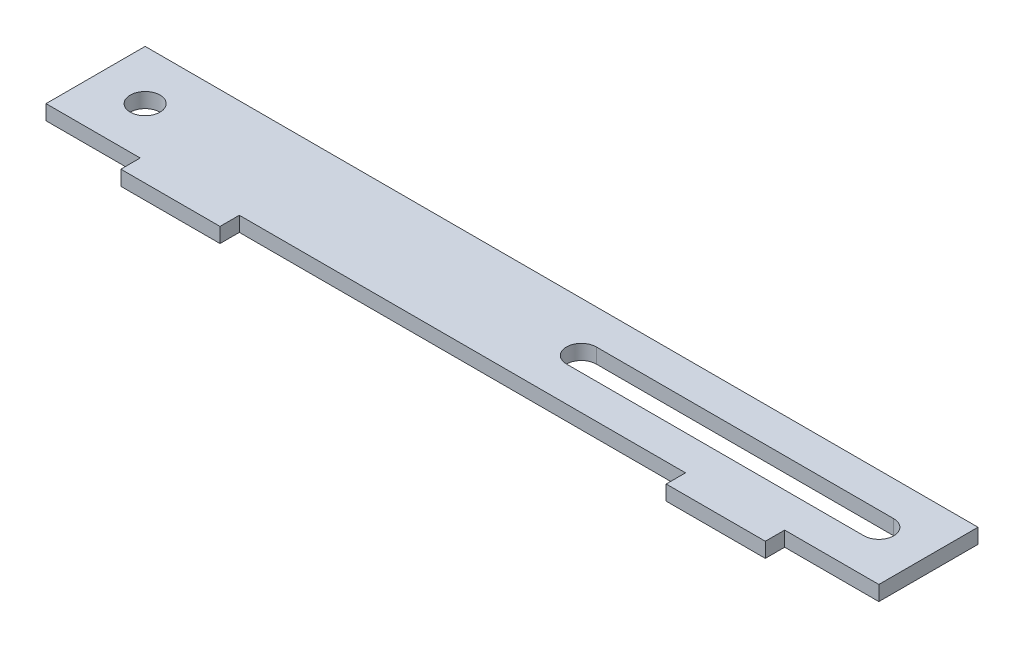
ISO-10303-21;
HEADER;
FILE_DESCRIPTION(('STEP AP214'),'2;1');
FILE_NAME('part.step','',(''),(''),'','','');
FILE_SCHEMA(('AUTOMOTIVE_DESIGN { 1 0 10303 214 1 1 1 1 }'));
ENDSEC;
DATA;
#1=APPLICATION_CONTEXT('core data for automotive mechanical design processes');
#2=APPLICATION_PROTOCOL_DEFINITION('international standard','automotive_design',2000,#1);
#3=PRODUCT_CONTEXT('',#1,'mechanical');
#4=PRODUCT('Part','Part','',(#3));
#5=PRODUCT_RELATED_PRODUCT_CATEGORY('part','',(#4));
#6=PRODUCT_DEFINITION_FORMATION('','',#4);
#7=PRODUCT_DEFINITION_CONTEXT('part definition',#1,'design');
#8=PRODUCT_DEFINITION('design','',#6,#7);
#9=PRODUCT_DEFINITION_SHAPE('','',#8);
#10=(LENGTH_UNIT() NAMED_UNIT(*) SI_UNIT(.MILLI.,.METRE.));
#11=(NAMED_UNIT(*) PLANE_ANGLE_UNIT() SI_UNIT($,.RADIAN.));
#12=(NAMED_UNIT(*) SI_UNIT($,.STERADIAN.) SOLID_ANGLE_UNIT());
#13=UNCERTAINTY_MEASURE_WITH_UNIT(LENGTH_MEASURE(1.E-05),#10,'distance_accuracy_value','');
#14=(GEOMETRIC_REPRESENTATION_CONTEXT(3) GLOBAL_UNCERTAINTY_ASSIGNED_CONTEXT((#13)) GLOBAL_UNIT_ASSIGNED_CONTEXT((#10,
#11,#12)) REPRESENTATION_CONTEXT('',''));
#15=CARTESIAN_POINT('',(0.,0.,0.));
#16=DIRECTION('',(0.,0.,1.));
#17=DIRECTION('',(1.,0.,0.));
#18=AXIS2_PLACEMENT_3D('',#15,#16,#17);
#19=CARTESIAN_POINT('',(0.,3.,0.));
#20=DIRECTION('',(0.,-1.,0.));
#21=DIRECTION('',(0.,0.,-1.));
#22=AXIS2_PLACEMENT_3D('',#19,#20,#21);
#23=PLANE('',#22);
#24=CARTESIAN_POINT('',(10.,3.,-10.));
#25=DIRECTION('',(0.,1.,0.));
#26=DIRECTION('',(0.,0.,1.));
#27=AXIS2_PLACEMENT_3D('',#24,#25,#26);
#28=CIRCLE('',#27,3.);
#29=CARTESIAN_POINT('',(10.,3.,-7.));
#30=VERTEX_POINT('',#29);
#31=EDGE_CURVE('E201',#30,#30,#28,.T.);
#32=ORIENTED_EDGE('',*,*,#31,.F.);
#33=EDGE_LOOP('',(#32));
#34=FACE_BOUND('',#33,.T.);
#35=DIRECTION('',(0.,0.,1.));
#36=VECTOR('',#35,1.);
#37=CARTESIAN_POINT('',(0.,3.,0.));
#38=LINE('',#37,#36);
#39=CARTESIAN_POINT('',(0.,3.,-20.));
#40=VERTEX_POINT('',#39);
#41=CARTESIAN_POINT('',(0.,3.,0.));
#42=VERTEX_POINT('',#41);
#43=EDGE_CURVE('E209',#40,#42,#38,.T.);
#44=ORIENTED_EDGE('',*,*,#43,.T.);
#45=DIRECTION('',(1.,0.,0.));
#46=VECTOR('',#45,1.);
#47=CARTESIAN_POINT('',(0.,3.,0.));
#48=LINE('',#47,#46);
#49=CARTESIAN_POINT('',(19.,3.,0.));
#50=VERTEX_POINT('',#49);
#51=EDGE_CURVE('E213',#42,#50,#48,.T.);
#52=ORIENTED_EDGE('',*,*,#51,.T.);
#53=DIRECTION('',(0.,0.,1.));
#54=VECTOR('',#53,1.);
#55=CARTESIAN_POINT('',(19.,3.,0.));
#56=LINE('',#55,#54);
#57=CARTESIAN_POINT('',(19.,3.,3.9));
#58=VERTEX_POINT('',#57);
#59=EDGE_CURVE('E217',#50,#58,#56,.T.);
#60=ORIENTED_EDGE('',*,*,#59,.T.);
#61=DIRECTION('',(1.,0.,0.));
#62=VECTOR('',#61,1.);
#63=CARTESIAN_POINT('',(19.,3.,3.9));
#64=LINE('',#63,#62);
#65=CARTESIAN_POINT('',(39.,3.,3.9));
#66=VERTEX_POINT('',#65);
#67=EDGE_CURVE('E220',#58,#66,#64,.T.);
#68=ORIENTED_EDGE('',*,*,#67,.T.);
#69=DIRECTION('',(0.,0.,-1.));
#70=VECTOR('',#69,1.);
#71=CARTESIAN_POINT('',(39.,3.,0.));
#72=LINE('',#71,#70);
#73=CARTESIAN_POINT('',(39.,3.,0.));
#74=VERTEX_POINT('',#73);
#75=EDGE_CURVE('E223',#66,#74,#72,.T.);
#76=ORIENTED_EDGE('',*,*,#75,.T.);
#77=DIRECTION('',(1.,0.,0.));
#78=VECTOR('',#77,1.);
#79=CARTESIAN_POINT('',(39.,3.,0.));
#80=LINE('',#79,#78);
#81=CARTESIAN_POINT('',(129.,3.,0.));
#82=VERTEX_POINT('',#81);
#83=EDGE_CURVE('E226',#74,#82,#80,.T.);
#84=ORIENTED_EDGE('',*,*,#83,.T.);
#85=DIRECTION('',(0.,0.,1.));
#86=VECTOR('',#85,1.);
#87=CARTESIAN_POINT('',(129.,3.,0.));
#88=LINE('',#87,#86);
#89=CARTESIAN_POINT('',(129.,3.,3.89999999999999));
#90=VERTEX_POINT('',#89);
#91=EDGE_CURVE('E229',#82,#90,#88,.T.);
#92=ORIENTED_EDGE('',*,*,#91,.T.);
#93=DIRECTION('',(1.,0.,0.));
#94=VECTOR('',#93,1.);
#95=CARTESIAN_POINT('',(149.,3.,3.89999999999998));
#96=LINE('',#95,#94);
#97=CARTESIAN_POINT('',(149.,3.,3.89999999999998));
#98=VERTEX_POINT('',#97);
#99=EDGE_CURVE('E232',#90,#98,#96,.T.);
#100=ORIENTED_EDGE('',*,*,#99,.T.);
#101=DIRECTION('',(0.,0.,-1.));
#102=VECTOR('',#101,1.);
#103=CARTESIAN_POINT('',(149.,3.,0.));
#104=LINE('',#103,#102);
#105=CARTESIAN_POINT('',(149.,3.,0.));
#106=VERTEX_POINT('',#105);
#107=EDGE_CURVE('E235',#98,#106,#104,.T.);
#108=ORIENTED_EDGE('',*,*,#107,.T.);
#109=DIRECTION('',(1.,0.,0.));
#110=VECTOR('',#109,1.);
#111=CARTESIAN_POINT('',(149.,3.,0.));
#112=LINE('',#111,#110);
#113=CARTESIAN_POINT('',(167.999999999999,3.,0.));
#114=VERTEX_POINT('',#113);
#115=EDGE_CURVE('E238',#106,#114,#112,.T.);
#116=ORIENTED_EDGE('',*,*,#115,.T.);
#117=DIRECTION('',(0.,0.,-1.));
#118=VECTOR('',#117,1.);
#119=CARTESIAN_POINT('',(167.999999999999,3.,0.));
#120=LINE('',#119,#118);
#121=CARTESIAN_POINT('',(168.,3.,-20.));
#122=VERTEX_POINT('',#121);
#123=EDGE_CURVE('E241',#114,#122,#120,.T.);
#124=ORIENTED_EDGE('',*,*,#123,.T.);
#125=DIRECTION('',(-1.,0.,0.));
#126=VECTOR('',#125,1.);
#127=CARTESIAN_POINT('',(0.,3.,-20.));
#128=LINE('',#127,#126);
#129=EDGE_CURVE('E244',#122,#40,#128,.T.);
#130=ORIENTED_EDGE('',*,*,#129,.T.);
#131=EDGE_LOOP('',(#44,#52,#60,#68,#76,#84,#92,#100,#108,#116,#124,#130));
#132=FACE_BOUND('',#131,.T.);
#133=CARTESIAN_POINT('',(158.,3.,-10.));
#134=DIRECTION('',(0.,1.,0.));
#135=DIRECTION('',(0.,0.,1.));
#136=AXIS2_PLACEMENT_3D('',#133,#134,#135);
#137=CIRCLE('',#136,3.);
#138=CARTESIAN_POINT('',(158.,3.,-7.00000000000002));
#139=VERTEX_POINT('',#138);
#140=CARTESIAN_POINT('',(158.,3.,-13.));
#141=VERTEX_POINT('',#140);
#142=EDGE_CURVE('E153',#139,#141,#137,.T.);
#143=ORIENTED_EDGE('',*,*,#142,.F.);
#144=DIRECTION('',(1.,0.,0.));
#145=VECTOR('',#144,1.);
#146=CARTESIAN_POINT('',(158.,3.,-7.00000000000002));
#147=LINE('',#146,#145);
#148=CARTESIAN_POINT('',(98.,3.,-7.00000000000001));
#149=VERTEX_POINT('',#148);
#150=EDGE_CURVE('E179',#149,#139,#147,.T.);
#151=ORIENTED_EDGE('',*,*,#150,.F.);
#152=CARTESIAN_POINT('',(98.,3.,-10.));
#153=DIRECTION('',(0.,1.,0.));
#154=DIRECTION('',(0.,0.,1.));
#155=AXIS2_PLACEMENT_3D('',#152,#153,#154);
#156=CIRCLE('',#155,3.);
#157=CARTESIAN_POINT('',(98.,3.,-13.));
#158=VERTEX_POINT('',#157);
#159=EDGE_CURVE('E175',#158,#149,#156,.T.);
#160=ORIENTED_EDGE('',*,*,#159,.F.);
#161=DIRECTION('',(-1.,0.,0.));
#162=VECTOR('',#161,1.);
#163=CARTESIAN_POINT('',(158.,3.,-13.));
#164=LINE('',#163,#162);
#165=EDGE_CURVE('E162',#141,#158,#164,.T.);
#166=ORIENTED_EDGE('',*,*,#165,.F.);
#167=EDGE_LOOP('',(#143,#151,#160,#166));
#168=FACE_BOUND('',#167,.T.);
#169=ADVANCED_FACE('F39',(#34,#132,#168),#23,.F.);
#170=CARTESIAN_POINT('',(0.,0.,0.));
#171=DIRECTION('',(0.,-1.,0.));
#172=DIRECTION('',(0.,0.,-1.));
#173=AXIS2_PLACEMENT_3D('',#170,#171,#172);
#174=PLANE('',#173);
#175=DIRECTION('',(0.,0.,1.));
#176=VECTOR('',#175,1.);
#177=CARTESIAN_POINT('',(0.,0.,0.));
#178=LINE('',#177,#176);
#179=CARTESIAN_POINT('',(0.,0.,-20.));
#180=VERTEX_POINT('',#179);
#181=CARTESIAN_POINT('',(0.,0.,0.));
#182=VERTEX_POINT('',#181);
#183=EDGE_CURVE('E205',#180,#182,#178,.T.);
#184=ORIENTED_EDGE('',*,*,#183,.F.);
#185=DIRECTION('',(-1.,0.,0.));
#186=VECTOR('',#185,1.);
#187=CARTESIAN_POINT('',(0.,0.,-20.));
#188=LINE('',#187,#186);
#189=CARTESIAN_POINT('',(168.,0.,-20.));
#190=VERTEX_POINT('',#189);
#191=EDGE_CURVE('E214',#190,#180,#188,.T.);
#192=ORIENTED_EDGE('',*,*,#191,.F.);
#193=DIRECTION('',(0.,0.,-1.));
#194=VECTOR('',#193,1.);
#195=CARTESIAN_POINT('',(167.999999999999,0.,0.));
#196=LINE('',#195,#194);
#197=CARTESIAN_POINT('',(167.999999999999,0.,0.));
#198=VERTEX_POINT('',#197);
#199=EDGE_CURVE('E278',#198,#190,#196,.T.);
#200=ORIENTED_EDGE('',*,*,#199,.F.);
#201=DIRECTION('',(1.,0.,0.));
#202=VECTOR('',#201,1.);
#203=CARTESIAN_POINT('',(149.,0.,0.));
#204=LINE('',#203,#202);
#205=CARTESIAN_POINT('',(149.,0.,0.));
#206=VERTEX_POINT('',#205);
#207=EDGE_CURVE('E275',#206,#198,#204,.T.);
#208=ORIENTED_EDGE('',*,*,#207,.F.);
#209=DIRECTION('',(0.,0.,-1.));
#210=VECTOR('',#209,1.);
#211=CARTESIAN_POINT('',(149.,0.,0.));
#212=LINE('',#211,#210);
#213=CARTESIAN_POINT('',(149.,0.,3.89999999999998));
#214=VERTEX_POINT('',#213);
#215=EDGE_CURVE('E272',#214,#206,#212,.T.);
#216=ORIENTED_EDGE('',*,*,#215,.F.);
#217=DIRECTION('',(1.,0.,0.));
#218=VECTOR('',#217,1.);
#219=CARTESIAN_POINT('',(149.,0.,3.89999999999998));
#220=LINE('',#219,#218);
#221=CARTESIAN_POINT('',(129.,0.,3.89999999999999));
#222=VERTEX_POINT('',#221);
#223=EDGE_CURVE('E269',#222,#214,#220,.T.);
#224=ORIENTED_EDGE('',*,*,#223,.F.);
#225=DIRECTION('',(0.,0.,1.));
#226=VECTOR('',#225,1.);
#227=CARTESIAN_POINT('',(129.,0.,0.));
#228=LINE('',#227,#226);
#229=CARTESIAN_POINT('',(129.,0.,0.));
#230=VERTEX_POINT('',#229);
#231=EDGE_CURVE('E266',#230,#222,#228,.T.);
#232=ORIENTED_EDGE('',*,*,#231,.F.);
#233=DIRECTION('',(1.,0.,0.));
#234=VECTOR('',#233,1.);
#235=CARTESIAN_POINT('',(39.,0.,0.));
#236=LINE('',#235,#234);
#237=CARTESIAN_POINT('',(39.,0.,0.));
#238=VERTEX_POINT('',#237);
#239=EDGE_CURVE('E263',#238,#230,#236,.T.);
#240=ORIENTED_EDGE('',*,*,#239,.F.);
#241=DIRECTION('',(0.,0.,-1.));
#242=VECTOR('',#241,1.);
#243=CARTESIAN_POINT('',(39.,0.,0.));
#244=LINE('',#243,#242);
#245=CARTESIAN_POINT('',(39.,0.,3.9));
#246=VERTEX_POINT('',#245);
#247=EDGE_CURVE('E260',#246,#238,#244,.T.);
#248=ORIENTED_EDGE('',*,*,#247,.F.);
#249=DIRECTION('',(1.,0.,0.));
#250=VECTOR('',#249,1.);
#251=CARTESIAN_POINT('',(19.,0.,3.9));
#252=LINE('',#251,#250);
#253=CARTESIAN_POINT('',(19.,0.,3.9));
#254=VERTEX_POINT('',#253);
#255=EDGE_CURVE('E257',#254,#246,#252,.T.);
#256=ORIENTED_EDGE('',*,*,#255,.F.);
#257=DIRECTION('',(0.,0.,1.));
#258=VECTOR('',#257,1.);
#259=CARTESIAN_POINT('',(19.,0.,0.));
#260=LINE('',#259,#258);
#261=CARTESIAN_POINT('',(19.,0.,0.));
#262=VERTEX_POINT('',#261);
#263=EDGE_CURVE('E254',#262,#254,#260,.T.);
#264=ORIENTED_EDGE('',*,*,#263,.F.);
#265=DIRECTION('',(1.,0.,0.));
#266=VECTOR('',#265,1.);
#267=CARTESIAN_POINT('',(0.,0.,0.));
#268=LINE('',#267,#266);
#269=EDGE_CURVE('E251',#182,#262,#268,.T.);
#270=ORIENTED_EDGE('',*,*,#269,.F.);
#271=EDGE_LOOP('',(#184,#192,#200,#208,#216,#224,#232,#240,#248,#256,#264,#270));
#272=FACE_BOUND('',#271,.T.);
#273=CARTESIAN_POINT('',(10.,0.,-10.));
#274=DIRECTION('',(0.,1.,0.));
#275=DIRECTION('',(0.,0.,1.));
#276=AXIS2_PLACEMENT_3D('',#273,#274,#275);
#277=CIRCLE('',#276,3.);
#278=CARTESIAN_POINT('',(10.,0.,-7.));
#279=VERTEX_POINT('',#278);
#280=EDGE_CURVE('E171',#279,#279,#277,.T.);
#281=ORIENTED_EDGE('',*,*,#280,.T.);
#282=EDGE_LOOP('',(#281));
#283=FACE_BOUND('',#282,.T.);
#284=DIRECTION('',(1.,0.,0.));
#285=VECTOR('',#284,1.);
#286=CARTESIAN_POINT('',(158.,0.,-7.00000000000002));
#287=LINE('',#286,#285);
#288=CARTESIAN_POINT('',(98.,0.,-7.00000000000001));
#289=VERTEX_POINT('',#288);
#290=CARTESIAN_POINT('',(158.,0.,-7.00000000000002));
#291=VERTEX_POINT('',#290);
#292=EDGE_CURVE('E163',#289,#291,#287,.T.);
#293=ORIENTED_EDGE('',*,*,#292,.T.);
#294=CARTESIAN_POINT('',(158.,0.,-10.));
#295=DIRECTION('',(0.,1.,0.));
#296=DIRECTION('',(0.,0.,1.));
#297=AXIS2_PLACEMENT_3D('',#294,#295,#296);
#298=CIRCLE('',#297,3.);
#299=CARTESIAN_POINT('',(158.,0.,-13.));
#300=VERTEX_POINT('',#299);
#301=EDGE_CURVE('E63',#291,#300,#298,.T.);
#302=ORIENTED_EDGE('',*,*,#301,.T.);
#303=DIRECTION('',(-1.,0.,0.));
#304=VECTOR('',#303,1.);
#305=CARTESIAN_POINT('',(158.,0.,-13.));
#306=LINE('',#305,#304);
#307=CARTESIAN_POINT('',(98.,0.,-13.));
#308=VERTEX_POINT('',#307);
#309=EDGE_CURVE('E169',#300,#308,#306,.T.);
#310=ORIENTED_EDGE('',*,*,#309,.T.);
#311=CARTESIAN_POINT('',(98.,0.,-10.));
#312=DIRECTION('',(0.,1.,0.));
#313=DIRECTION('',(0.,0.,1.));
#314=AXIS2_PLACEMENT_3D('',#311,#312,#313);
#315=CIRCLE('',#314,3.);
#316=EDGE_CURVE('E188',#308,#289,#315,.T.);
#317=ORIENTED_EDGE('',*,*,#316,.T.);
#318=EDGE_LOOP('',(#293,#302,#310,#317));
#319=FACE_BOUND('',#318,.T.);
#320=ADVANCED_FACE('F333',(#272,#283,#319),#174,.T.);
#321=CARTESIAN_POINT('',(0.,3.,0.));
#322=DIRECTION('',(1.,0.,0.));
#323=DIRECTION('',(0.,0.,-1.));
#324=AXIS2_PLACEMENT_3D('',#321,#322,#323);
#325=PLANE('',#324);
#326=ORIENTED_EDGE('',*,*,#183,.T.);
#327=DIRECTION('',(0.,-1.,0.));
#328=VECTOR('',#327,1.);
#329=CARTESIAN_POINT('',(0.,3.,0.));
#330=LINE('',#329,#328);
#331=EDGE_CURVE('E11',#42,#182,#330,.T.);
#332=ORIENTED_EDGE('',*,*,#331,.F.);
#333=ORIENTED_EDGE('',*,*,#43,.F.);
#334=DIRECTION('',(0.,-1.,0.));
#335=VECTOR('',#334,1.);
#336=CARTESIAN_POINT('',(0.,3.,-20.));
#337=LINE('',#336,#335);
#338=EDGE_CURVE('E247',#40,#180,#337,.T.);
#339=ORIENTED_EDGE('',*,*,#338,.T.);
#340=EDGE_LOOP('',(#326,#332,#333,#339));
#341=FACE_BOUND('',#340,.T.);
#342=ADVANCED_FACE('F41',(#341),#325,.F.);
#343=CARTESIAN_POINT('',(0.,3.,0.));
#344=DIRECTION('',(0.,0.,-1.));
#345=DIRECTION('',(-1.,0.,0.));
#346=AXIS2_PLACEMENT_3D('',#343,#344,#345);
#347=PLANE('',#346);
#348=ORIENTED_EDGE('',*,*,#269,.T.);
#349=DIRECTION('',(0.,-1.,0.));
#350=VECTOR('',#349,1.);
#351=CARTESIAN_POINT('',(19.,3.,0.));
#352=LINE('',#351,#350);
#353=EDGE_CURVE('E48',#50,#262,#352,.T.);
#354=ORIENTED_EDGE('',*,*,#353,.F.);
#355=ORIENTED_EDGE('',*,*,#51,.F.);
#356=ORIENTED_EDGE('',*,*,#331,.T.);
#357=EDGE_LOOP('',(#348,#354,#355,#356));
#358=FACE_BOUND('',#357,.T.);
#359=ADVANCED_FACE('F350',(#358),#347,.F.);
#360=CARTESIAN_POINT('',(19.,3.,0.));
#361=DIRECTION('',(1.,0.,0.));
#362=DIRECTION('',(0.,0.,-1.));
#363=AXIS2_PLACEMENT_3D('',#360,#361,#362);
#364=PLANE('',#363);
#365=ORIENTED_EDGE('',*,*,#263,.T.);
#366=DIRECTION('',(0.,-1.,0.));
#367=VECTOR('',#366,1.);
#368=CARTESIAN_POINT('',(19.,3.,3.9));
#369=LINE('',#368,#367);
#370=EDGE_CURVE('E318',#58,#254,#369,.T.);
#371=ORIENTED_EDGE('',*,*,#370,.F.);
#372=ORIENTED_EDGE('',*,*,#59,.F.);
#373=ORIENTED_EDGE('',*,*,#353,.T.);
#374=EDGE_LOOP('',(#365,#371,#372,#373));
#375=FACE_BOUND('',#374,.T.);
#376=ADVANCED_FACE('F327',(#375),#364,.F.);
#377=CARTESIAN_POINT('',(19.,3.,3.9));
#378=DIRECTION('',(0.,0.,-1.));
#379=DIRECTION('',(-1.,0.,0.));
#380=AXIS2_PLACEMENT_3D('',#377,#378,#379);
#381=PLANE('',#380);
#382=ORIENTED_EDGE('',*,*,#255,.T.);
#383=DIRECTION('',(0.,-1.,0.));
#384=VECTOR('',#383,1.);
#385=CARTESIAN_POINT('',(39.,3.,3.9));
#386=LINE('',#385,#384);
#387=EDGE_CURVE('E314',#66,#246,#386,.T.);
#388=ORIENTED_EDGE('',*,*,#387,.F.);
#389=ORIENTED_EDGE('',*,*,#67,.F.);
#390=ORIENTED_EDGE('',*,*,#370,.T.);
#391=EDGE_LOOP('',(#382,#388,#389,#390));
#392=FACE_BOUND('',#391,.T.);
#393=ADVANCED_FACE('F339',(#392),#381,.F.);
#394=CARTESIAN_POINT('',(39.,3.,0.));
#395=DIRECTION('',(-1.,0.,0.));
#396=DIRECTION('',(0.,0.,1.));
#397=AXIS2_PLACEMENT_3D('',#394,#395,#396);
#398=PLANE('',#397);
#399=ORIENTED_EDGE('',*,*,#247,.T.);
#400=DIRECTION('',(0.,-1.,0.));
#401=VECTOR('',#400,1.);
#402=CARTESIAN_POINT('',(39.,3.,0.));
#403=LINE('',#402,#401);
#404=EDGE_CURVE('E310',#74,#238,#403,.T.);
#405=ORIENTED_EDGE('',*,*,#404,.F.);
#406=ORIENTED_EDGE('',*,*,#75,.F.);
#407=ORIENTED_EDGE('',*,*,#387,.T.);
#408=EDGE_LOOP('',(#399,#405,#406,#407));
#409=FACE_BOUND('',#408,.T.);
#410=ADVANCED_FACE('F343',(#409),#398,.F.);
#411=CARTESIAN_POINT('',(39.,3.,0.));
#412=DIRECTION('',(0.,0.,-1.));
#413=DIRECTION('',(-1.,0.,0.));
#414=AXIS2_PLACEMENT_3D('',#411,#412,#413);
#415=PLANE('',#414);
#416=ORIENTED_EDGE('',*,*,#239,.T.);
#417=DIRECTION('',(0.,-1.,0.));
#418=VECTOR('',#417,1.);
#419=CARTESIAN_POINT('',(129.,3.,0.));
#420=LINE('',#419,#418);
#421=EDGE_CURVE('E306',#82,#230,#420,.T.);
#422=ORIENTED_EDGE('',*,*,#421,.F.);
#423=ORIENTED_EDGE('',*,*,#83,.F.);
#424=ORIENTED_EDGE('',*,*,#404,.T.);
#425=EDGE_LOOP('',(#416,#422,#423,#424));
#426=FACE_BOUND('',#425,.T.);
#427=ADVANCED_FACE('F383',(#426),#415,.F.);
#428=CARTESIAN_POINT('',(129.,3.,0.));
#429=DIRECTION('',(1.,0.,0.));
#430=DIRECTION('',(0.,0.,-1.));
#431=AXIS2_PLACEMENT_3D('',#428,#429,#430);
#432=PLANE('',#431);
#433=ORIENTED_EDGE('',*,*,#231,.T.);
#434=DIRECTION('',(0.,-1.,0.));
#435=VECTOR('',#434,1.);
#436=CARTESIAN_POINT('',(129.,3.,3.89999999999999));
#437=LINE('',#436,#435);
#438=EDGE_CURVE('E302',#90,#222,#437,.T.);
#439=ORIENTED_EDGE('',*,*,#438,.F.);
#440=ORIENTED_EDGE('',*,*,#91,.F.);
#441=ORIENTED_EDGE('',*,*,#421,.T.);
#442=EDGE_LOOP('',(#433,#439,#440,#441));
#443=FACE_BOUND('',#442,.T.);
#444=ADVANCED_FACE('F381',(#443),#432,.F.);
#445=CARTESIAN_POINT('',(149.,3.,3.89999999999998));
#446=DIRECTION('',(0.,0.,-1.));
#447=DIRECTION('',(-1.,0.,0.));
#448=AXIS2_PLACEMENT_3D('',#445,#446,#447);
#449=PLANE('',#448);
#450=ORIENTED_EDGE('',*,*,#223,.T.);
#451=DIRECTION('',(0.,-1.,0.));
#452=VECTOR('',#451,1.);
#453=CARTESIAN_POINT('',(149.,3.,3.89999999999998));
#454=LINE('',#453,#452);
#455=EDGE_CURVE('E298',#98,#214,#454,.T.);
#456=ORIENTED_EDGE('',*,*,#455,.F.);
#457=ORIENTED_EDGE('',*,*,#99,.F.);
#458=ORIENTED_EDGE('',*,*,#438,.T.);
#459=EDGE_LOOP('',(#450,#456,#457,#458));
#460=FACE_BOUND('',#459,.T.);
#461=ADVANCED_FACE('F377',(#460),#449,.F.);
#462=CARTESIAN_POINT('',(149.,3.,0.));
#463=DIRECTION('',(-1.,0.,0.));
#464=DIRECTION('',(0.,0.,1.));
#465=AXIS2_PLACEMENT_3D('',#462,#463,#464);
#466=PLANE('',#465);
#467=ORIENTED_EDGE('',*,*,#215,.T.);
#468=DIRECTION('',(0.,-1.,0.));
#469=VECTOR('',#468,1.);
#470=CARTESIAN_POINT('',(149.,3.,0.));
#471=LINE('',#470,#469);
#472=EDGE_CURVE('E294',#106,#206,#471,.T.);
#473=ORIENTED_EDGE('',*,*,#472,.F.);
#474=ORIENTED_EDGE('',*,*,#107,.F.);
#475=ORIENTED_EDGE('',*,*,#455,.T.);
#476=EDGE_LOOP('',(#467,#473,#474,#475));
#477=FACE_BOUND('',#476,.T.);
#478=ADVANCED_FACE('F372',(#477),#466,.F.);
#479=CARTESIAN_POINT('',(149.,3.,0.));
#480=DIRECTION('',(0.,0.,-1.));
#481=DIRECTION('',(-1.,0.,0.));
#482=AXIS2_PLACEMENT_3D('',#479,#480,#481);
#483=PLANE('',#482);
#484=ORIENTED_EDGE('',*,*,#207,.T.);
#485=DIRECTION('',(0.,-1.,0.));
#486=VECTOR('',#485,1.);
#487=CARTESIAN_POINT('',(167.999999999999,3.,0.));
#488=LINE('',#487,#486);
#489=EDGE_CURVE('E290',#114,#198,#488,.T.);
#490=ORIENTED_EDGE('',*,*,#489,.F.);
#491=ORIENTED_EDGE('',*,*,#115,.F.);
#492=ORIENTED_EDGE('',*,*,#472,.T.);
#493=EDGE_LOOP('',(#484,#490,#491,#492));
#494=FACE_BOUND('',#493,.T.);
#495=ADVANCED_FACE('F366',(#494),#483,.F.);
#496=CARTESIAN_POINT('',(167.999999999999,3.,0.));
#497=DIRECTION('',(-1.,0.,0.));
#498=DIRECTION('',(0.,0.,1.));
#499=AXIS2_PLACEMENT_3D('',#496,#497,#498);
#500=PLANE('',#499);
#501=ORIENTED_EDGE('',*,*,#199,.T.);
#502=DIRECTION('',(0.,-1.,0.));
#503=VECTOR('',#502,1.);
#504=CARTESIAN_POINT('',(168.,3.,-20.));
#505=LINE('',#504,#503);
#506=EDGE_CURVE('E286',#122,#190,#505,.T.);
#507=ORIENTED_EDGE('',*,*,#506,.F.);
#508=ORIENTED_EDGE('',*,*,#123,.F.);
#509=ORIENTED_EDGE('',*,*,#489,.T.);
#510=EDGE_LOOP('',(#501,#507,#508,#509));
#511=FACE_BOUND('',#510,.T.);
#512=ADVANCED_FACE('F362',(#511),#500,.F.);
#513=CARTESIAN_POINT('',(0.,3.,-20.));
#514=DIRECTION('',(0.,0.,1.));
#515=DIRECTION('',(1.,0.,0.));
#516=AXIS2_PLACEMENT_3D('',#513,#514,#515);
#517=PLANE('',#516);
#518=ORIENTED_EDGE('',*,*,#191,.T.);
#519=ORIENTED_EDGE('',*,*,#338,.F.);
#520=ORIENTED_EDGE('',*,*,#129,.F.);
#521=ORIENTED_EDGE('',*,*,#506,.T.);
#522=EDGE_LOOP('',(#518,#519,#520,#521));
#523=FACE_BOUND('',#522,.T.);
#524=ADVANCED_FACE('F357',(#523),#517,.F.);
#525=CARTESIAN_POINT('',(10.,3.,-10.));
#526=DIRECTION('',(0.,-1.,0.));
#527=DIRECTION('',(0.,0.,-1.));
#528=AXIS2_PLACEMENT_3D('',#525,#526,#527);
#529=CYLINDRICAL_SURFACE('',#528,3.);
#530=ORIENTED_EDGE('',*,*,#31,.T.);
#531=EDGE_LOOP('',(#530));
#532=FACE_BOUND('',#531,.T.);
#533=ORIENTED_EDGE('',*,*,#280,.F.);
#534=EDGE_LOOP('',(#533));
#535=FACE_BOUND('',#534,.T.);
#536=ADVANCED_FACE('F401',(#532,#535),#529,.F.);
#537=CARTESIAN_POINT('',(158.,3.,-10.));
#538=DIRECTION('',(0.,-1.,0.));
#539=DIRECTION('',(0.,0.,-1.));
#540=AXIS2_PLACEMENT_3D('',#537,#538,#539);
#541=CYLINDRICAL_SURFACE('',#540,3.);
#542=ORIENTED_EDGE('',*,*,#301,.F.);
#543=DIRECTION('',(0.,-1.,0.));
#544=VECTOR('',#543,1.);
#545=CARTESIAN_POINT('',(158.,3.,-7.00000000000002));
#546=LINE('',#545,#544);
#547=EDGE_CURVE('E157',#139,#291,#546,.T.);
#548=ORIENTED_EDGE('',*,*,#547,.F.);
#549=ORIENTED_EDGE('',*,*,#142,.T.);
#550=DIRECTION('',(0.,-1.,0.));
#551=VECTOR('',#550,1.);
#552=CARTESIAN_POINT('',(158.,3.,-13.));
#553=LINE('',#552,#551);
#554=EDGE_CURVE('E156',#141,#300,#553,.T.);
#555=ORIENTED_EDGE('',*,*,#554,.T.);
#556=EDGE_LOOP('',(#542,#548,#549,#555));
#557=FACE_BOUND('',#556,.T.);
#558=ADVANCED_FACE('F155',(#557),#541,.F.);
#559=CARTESIAN_POINT('',(158.,3.,-13.));
#560=DIRECTION('',(0.,0.,1.));
#561=DIRECTION('',(1.,0.,0.));
#562=AXIS2_PLACEMENT_3D('',#559,#560,#561);
#563=PLANE('',#562);
#564=ORIENTED_EDGE('',*,*,#309,.F.);
#565=ORIENTED_EDGE('',*,*,#554,.F.);
#566=ORIENTED_EDGE('',*,*,#165,.T.);
#567=DIRECTION('',(0.,-1.,0.));
#568=VECTOR('',#567,1.);
#569=CARTESIAN_POINT('',(98.,3.,-13.));
#570=LINE('',#569,#568);
#571=EDGE_CURVE('E172',#158,#308,#570,.T.);
#572=ORIENTED_EDGE('',*,*,#571,.T.);
#573=EDGE_LOOP('',(#564,#565,#566,#572));
#574=FACE_BOUND('',#573,.T.);
#575=ADVANCED_FACE('F166',(#574),#563,.T.);
#576=CARTESIAN_POINT('',(98.,3.,-10.));
#577=DIRECTION('',(0.,-1.,0.));
#578=DIRECTION('',(0.,0.,-1.));
#579=AXIS2_PLACEMENT_3D('',#576,#577,#578);
#580=CYLINDRICAL_SURFACE('',#579,3.);
#581=ORIENTED_EDGE('',*,*,#316,.F.);
#582=ORIENTED_EDGE('',*,*,#571,.F.);
#583=ORIENTED_EDGE('',*,*,#159,.T.);
#584=DIRECTION('',(0.,-1.,0.));
#585=VECTOR('',#584,1.);
#586=CARTESIAN_POINT('',(98.,3.,-7.00000000000001));
#587=LINE('',#586,#585);
#588=EDGE_CURVE('E55',#149,#289,#587,.T.);
#589=ORIENTED_EDGE('',*,*,#588,.T.);
#590=EDGE_LOOP('',(#581,#582,#583,#589));
#591=FACE_BOUND('',#590,.T.);
#592=ADVANCED_FACE('F450',(#591),#580,.F.);
#593=CARTESIAN_POINT('',(158.,3.,-7.00000000000002));
#594=DIRECTION('',(0.,0.,-1.));
#595=DIRECTION('',(-1.,0.,0.));
#596=AXIS2_PLACEMENT_3D('',#593,#594,#595);
#597=PLANE('',#596);
#598=ORIENTED_EDGE('',*,*,#292,.F.);
#599=ORIENTED_EDGE('',*,*,#588,.F.);
#600=ORIENTED_EDGE('',*,*,#150,.T.);
#601=ORIENTED_EDGE('',*,*,#547,.T.);
#602=EDGE_LOOP('',(#598,#599,#600,#601));
#603=FACE_BOUND('',#602,.T.);
#604=ADVANCED_FACE('F457',(#603),#597,.T.);
#605=CLOSED_SHELL('',(#169,#320,#342,#359,#376,#393,#410,#427,#444,#461,#478,#495,#512,#524,
#536,#558,#575,#592,#604));
#606=MANIFOLD_SOLID_BREP('B2',#605);
#607=ADVANCED_BREP_SHAPE_REPRESENTATION('',(#18,#606),#14);
#608=SHAPE_DEFINITION_REPRESENTATION(#9,#607);
ENDSEC;
END-ISO-10303-21;
